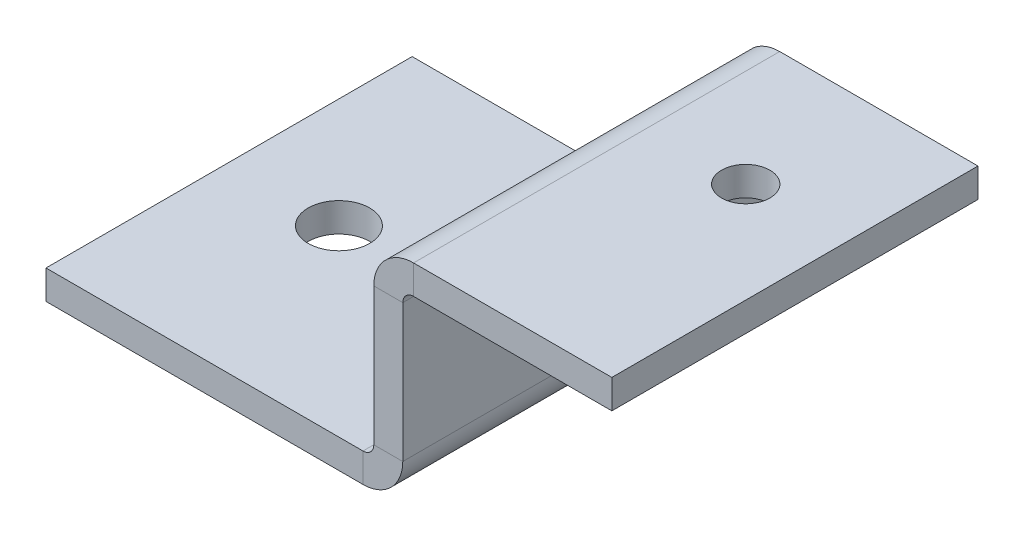
ISO-10303-21;
HEADER;
FILE_DESCRIPTION(('STEP AP214'),'2;1');
FILE_NAME('part.step','',(''),(''),'','','');
FILE_SCHEMA(('AUTOMOTIVE_DESIGN { 1 0 10303 214 1 1 1 1 }'));
ENDSEC;
DATA;
#1=APPLICATION_CONTEXT('core data for automotive mechanical design processes');
#2=APPLICATION_PROTOCOL_DEFINITION('international standard','automotive_design',2000,#1);
#3=PRODUCT_CONTEXT('',#1,'mechanical');
#4=PRODUCT('Part','Part','',(#3));
#5=PRODUCT_RELATED_PRODUCT_CATEGORY('part','',(#4));
#6=PRODUCT_DEFINITION_FORMATION('','',#4);
#7=PRODUCT_DEFINITION_CONTEXT('part definition',#1,'design');
#8=PRODUCT_DEFINITION('design','',#6,#7);
#9=PRODUCT_DEFINITION_SHAPE('','',#8);
#10=(LENGTH_UNIT() NAMED_UNIT(*) SI_UNIT(.MILLI.,.METRE.));
#11=(NAMED_UNIT(*) PLANE_ANGLE_UNIT() SI_UNIT($,.RADIAN.));
#12=(NAMED_UNIT(*) SI_UNIT($,.STERADIAN.) SOLID_ANGLE_UNIT());
#13=UNCERTAINTY_MEASURE_WITH_UNIT(LENGTH_MEASURE(1.E-05),#10,'distance_accuracy_value','');
#14=(GEOMETRIC_REPRESENTATION_CONTEXT(3) GLOBAL_UNCERTAINTY_ASSIGNED_CONTEXT((#13)) GLOBAL_UNIT_ASSIGNED_CONTEXT((#10,
#11,#12)) REPRESENTATION_CONTEXT('',''));
#15=CARTESIAN_POINT('',(0.,0.,0.));
#16=DIRECTION('',(0.,0.,1.));
#17=DIRECTION('',(1.,0.,0.));
#18=AXIS2_PLACEMENT_3D('',#15,#16,#17);
#19=CARTESIAN_POINT('',(-0.639468468922137,26.380531531078,-12.5));
#20=DIRECTION('',(0.,0.,-1.));
#21=DIRECTION('',(0.,-1.,0.));
#22=AXIS2_PLACEMENT_3D('',#19,#20,#21);
#23=PLANE('',#22);
#24=DIRECTION('',(0.,-1.,0.));
#25=VECTOR('',#24,1.);
#26=CARTESIAN_POINT('',(-2.61946846892214,26.380531531078,-12.5));
#27=LINE('',#26,#25);
#28=CARTESIAN_POINT('',(-2.61946846892208,10.130531531078,-12.5));
#29=VERTEX_POINT('',#28);
#30=CARTESIAN_POINT('',(-2.61946846892205,0.736600000000006,-12.5));
#31=VERTEX_POINT('',#30);
#32=EDGE_CURVE('E72',#29,#31,#27,.T.);
#33=ORIENTED_EDGE('',*,*,#32,.F.);
#34=DIRECTION('',(1.,0.,0.));
#35=VECTOR('',#34,1.);
#36=CARTESIAN_POINT('',(-0.639468468922081,10.130531531078,-12.5));
#37=LINE('',#36,#35);
#38=CARTESIAN_POINT('',(-0.639468468922081,10.130531531078,-12.5));
#39=VERTEX_POINT('',#38);
#40=EDGE_CURVE('E243',#29,#39,#37,.T.);
#41=ORIENTED_EDGE('',*,*,#40,.T.);
#42=DIRECTION('',(0.,-1.,0.));
#43=VECTOR('',#42,1.);
#44=CARTESIAN_POINT('',(-0.639468468922137,26.380531531078,-12.5));
#45=LINE('',#44,#43);
#46=CARTESIAN_POINT('',(-0.639468468922048,0.736600000000013,-12.5));
#47=VERTEX_POINT('',#46);
#48=EDGE_CURVE('E249',#39,#47,#45,.T.);
#49=ORIENTED_EDGE('',*,*,#48,.T.);
#50=DIRECTION('',(1.,0.,0.));
#51=VECTOR('',#50,1.);
#52=CARTESIAN_POINT('',(-0.639468468922048,0.736600000000013,-12.5));
#53=LINE('',#52,#51);
#54=EDGE_CURVE('E237',#31,#47,#53,.T.);
#55=ORIENTED_EDGE('',*,*,#54,.F.);
#56=EDGE_LOOP('',(#33,#41,#49,#55));
#57=FACE_BOUND('',#56,.T.);
#58=ADVANCED_FACE('F47',(#57),#23,.T.);
#59=CARTESIAN_POINT('',(-0.639468468922134,26.380531531078,12.5));
#60=DIRECTION('',(0.,0.,1.));
#61=DIRECTION('',(0.,1.,0.));
#62=AXIS2_PLACEMENT_3D('',#59,#60,#61);
#63=PLANE('',#62);
#64=DIRECTION('',(0.,1.,0.));
#65=VECTOR('',#64,1.);
#66=CARTESIAN_POINT('',(-0.639468468922134,26.380531531078,12.5));
#67=LINE('',#66,#65);
#68=CARTESIAN_POINT('',(-0.639468468922042,0.736600000000008,12.5));
#69=VERTEX_POINT('',#68);
#70=CARTESIAN_POINT('',(-0.639468468922078,10.130531531078,12.5));
#71=VERTEX_POINT('',#70);
#72=EDGE_CURVE('E232',#69,#71,#67,.T.);
#73=ORIENTED_EDGE('',*,*,#72,.T.);
#74=DIRECTION('',(-1.,0.,0.));
#75=VECTOR('',#74,1.);
#76=CARTESIAN_POINT('',(-0.639468468922077,10.130531531078,12.5));
#77=LINE('',#76,#75);
#78=CARTESIAN_POINT('',(-2.61946846892208,10.130531531078,12.5));
#79=VERTEX_POINT('',#78);
#80=EDGE_CURVE('E12',#71,#79,#77,.T.);
#81=ORIENTED_EDGE('',*,*,#80,.T.);
#82=DIRECTION('',(0.,1.,0.));
#83=VECTOR('',#82,1.);
#84=CARTESIAN_POINT('',(-2.61946846892213,26.380531531078,12.5));
#85=LINE('',#84,#83);
#86=CARTESIAN_POINT('',(-2.61946846892204,0.736600000000003,12.5));
#87=VERTEX_POINT('',#86);
#88=EDGE_CURVE('E250',#87,#79,#85,.T.);
#89=ORIENTED_EDGE('',*,*,#88,.F.);
#90=DIRECTION('',(-1.,0.,0.));
#91=VECTOR('',#90,1.);
#92=CARTESIAN_POINT('',(-0.639468468922045,0.736600000000013,12.5));
#93=LINE('',#92,#91);
#94=EDGE_CURVE('E231',#69,#87,#93,.T.);
#95=ORIENTED_EDGE('',*,*,#94,.F.);
#96=EDGE_LOOP('',(#73,#81,#89,#95));
#97=FACE_BOUND('',#96,.T.);
#98=ADVANCED_FACE('F49',(#97),#63,.T.);
#99=CARTESIAN_POINT('',(-0.639468468922049,1.38053153107798,0.));
#100=DIRECTION('',(1.,0.,0.));
#101=DIRECTION('',(0.,0.,-1.));
#102=AXIS2_PLACEMENT_3D('',#99,#100,#101);
#103=PLANE('',#102);
#104=ORIENTED_EDGE('',*,*,#48,.F.);
#105=DIRECTION('',(0.,0.,1.));
#106=VECTOR('',#105,1.);
#107=CARTESIAN_POINT('',(-0.639468468922079,10.130531531078,0.));
#108=LINE('',#107,#106);
#109=EDGE_CURVE('E240',#39,#71,#108,.T.);
#110=ORIENTED_EDGE('',*,*,#109,.T.);
#111=ORIENTED_EDGE('',*,*,#72,.F.);
#112=DIRECTION('',(0.,0.,1.));
#113=VECTOR('',#112,1.);
#114=CARTESIAN_POINT('',(-0.639468468922046,0.736600000000012,0.));
#115=LINE('',#114,#113);
#116=EDGE_CURVE('E228',#47,#69,#115,.T.);
#117=ORIENTED_EDGE('',*,*,#116,.F.);
#118=EDGE_LOOP('',(#104,#110,#111,#117));
#119=FACE_BOUND('',#118,.T.);
#120=ADVANCED_FACE('F288',(#119),#103,.T.);
#121=CARTESIAN_POINT('',(-2.61946846892205,1.38053153107797,0.));
#122=DIRECTION('',(1.,0.,0.));
#123=DIRECTION('',(0.,0.,-1.));
#124=AXIS2_PLACEMENT_3D('',#121,#122,#123);
#125=PLANE('',#124);
#126=DIRECTION('',(0.,0.,1.));
#127=VECTOR('',#126,1.);
#128=CARTESIAN_POINT('',(-2.61946846892208,10.130531531078,0.));
#129=LINE('',#128,#127);
#130=EDGE_CURVE('E56',#29,#79,#129,.T.);
#131=ORIENTED_EDGE('',*,*,#130,.F.);
#132=ORIENTED_EDGE('',*,*,#32,.T.);
#133=DIRECTION('',(0.,0.,1.));
#134=VECTOR('',#133,1.);
#135=CARTESIAN_POINT('',(-2.61946846892205,0.736600000000005,0.));
#136=LINE('',#135,#134);
#137=EDGE_CURVE('E235',#31,#87,#136,.T.);
#138=ORIENTED_EDGE('',*,*,#137,.T.);
#139=ORIENTED_EDGE('',*,*,#88,.T.);
#140=EDGE_LOOP('',(#131,#132,#138,#139));
#141=FACE_BOUND('',#140,.T.);
#142=ADVANCED_FACE('F342',(#141),#125,.F.);
#143=CARTESIAN_POINT('',(-25.,-1.98,12.5));
#144=DIRECTION('',(-1.,0.,0.));
#145=DIRECTION('',(0.,0.,1.));
#146=AXIS2_PLACEMENT_3D('',#143,#144,#145);
#147=PLANE('',#146);
#148=DIRECTION('',(0.,0.,1.));
#149=VECTOR('',#148,1.);
#150=CARTESIAN_POINT('',(-25.,0.,12.5));
#151=LINE('',#150,#149);
#152=CARTESIAN_POINT('',(-25.,0.,-12.5));
#153=VERTEX_POINT('',#152);
#154=CARTESIAN_POINT('',(-25.,0.,12.5));
#155=VERTEX_POINT('',#154);
#156=EDGE_CURVE('E207',#153,#155,#151,.T.);
#157=ORIENTED_EDGE('',*,*,#156,.F.);
#158=DIRECTION('',(0.,1.,0.));
#159=VECTOR('',#158,1.);
#160=CARTESIAN_POINT('',(-25.,-1.98,-12.5));
#161=LINE('',#160,#159);
#162=CARTESIAN_POINT('',(-25.,-1.98,-12.5));
#163=VERTEX_POINT('',#162);
#164=EDGE_CURVE('E196',#163,#153,#161,.T.);
#165=ORIENTED_EDGE('',*,*,#164,.F.);
#166=DIRECTION('',(0.,0.,1.));
#167=VECTOR('',#166,1.);
#168=CARTESIAN_POINT('',(-25.,-1.98,12.5));
#169=LINE('',#168,#167);
#170=CARTESIAN_POINT('',(-25.,-1.98,12.5));
#171=VERTEX_POINT('',#170);
#172=EDGE_CURVE('E223',#163,#171,#169,.T.);
#173=ORIENTED_EDGE('',*,*,#172,.T.);
#174=DIRECTION('',(0.,1.,0.));
#175=VECTOR('',#174,1.);
#176=CARTESIAN_POINT('',(-25.,-1.98,12.5));
#177=LINE('',#176,#175);
#178=EDGE_CURVE('E221',#171,#155,#177,.T.);
#179=ORIENTED_EDGE('',*,*,#178,.T.);
#180=EDGE_LOOP('',(#157,#165,#173,#179));
#181=FACE_BOUND('',#180,.T.);
#182=ADVANCED_FACE('F344',(#181),#147,.T.);
#183=CARTESIAN_POINT('',(0.,-1.98,0.));
#184=DIRECTION('',(0.,-1.,0.));
#185=DIRECTION('',(0.,0.,-1.));
#186=AXIS2_PLACEMENT_3D('',#183,#184,#185);
#187=PLANE('',#186);
#188=CARTESIAN_POINT('',(-17.5,-1.98,0.));
#189=DIRECTION('',(0.,-1.,0.));
#190=DIRECTION('',(0.,0.,-1.));
#191=AXIS2_PLACEMENT_3D('',#188,#189,#190);
#192=CIRCLE('',#191,2.1);
#193=CARTESIAN_POINT('',(-17.5,-1.98,-2.1));
#194=VERTEX_POINT('',#193);
#195=EDGE_CURVE('E255',#194,#194,#192,.T.);
#196=ORIENTED_EDGE('',*,*,#195,.F.);
#197=EDGE_LOOP('',(#196));
#198=FACE_BOUND('',#197,.T.);
#199=DIRECTION('',(-1.,0.,0.));
#200=VECTOR('',#199,1.);
#201=CARTESIAN_POINT('',(25.,-1.98,-12.5));
#202=LINE('',#201,#200);
#203=CARTESIAN_POINT('',(-3.35606846892205,-1.98,-12.5));
#204=VERTEX_POINT('',#203);
#205=EDGE_CURVE('E199',#204,#163,#202,.T.);
#206=ORIENTED_EDGE('',*,*,#205,.F.);
#207=DIRECTION('',(0.,0.,1.));
#208=VECTOR('',#207,1.);
#209=CARTESIAN_POINT('',(-3.35606846892204,-1.98,0.));
#210=LINE('',#209,#208);
#211=CARTESIAN_POINT('',(-3.35606846892204,-1.98,12.5));
#212=VERTEX_POINT('',#211);
#213=EDGE_CURVE('E218',#204,#212,#210,.T.);
#214=ORIENTED_EDGE('',*,*,#213,.T.);
#215=DIRECTION('',(1.,0.,0.));
#216=VECTOR('',#215,1.);
#217=CARTESIAN_POINT('',(25.,-1.98,12.5));
#218=LINE('',#217,#216);
#219=EDGE_CURVE('E215',#171,#212,#218,.T.);
#220=ORIENTED_EDGE('',*,*,#219,.F.);
#221=ORIENTED_EDGE('',*,*,#172,.F.);
#222=EDGE_LOOP('',(#206,#214,#220,#221));
#223=FACE_BOUND('',#222,.T.);
#224=ADVANCED_FACE('F313',(#198,#223),#187,.T.);
#225=CARTESIAN_POINT('',(25.,-1.98,12.5));
#226=DIRECTION('',(0.,0.,1.));
#227=DIRECTION('',(1.,0.,0.));
#228=AXIS2_PLACEMENT_3D('',#225,#226,#227);
#229=PLANE('',#228);
#230=ORIENTED_EDGE('',*,*,#219,.T.);
#231=DIRECTION('',(0.,1.,0.));
#232=VECTOR('',#231,1.);
#233=CARTESIAN_POINT('',(-3.35606846892204,-1.98,12.5));
#234=LINE('',#233,#232);
#235=CARTESIAN_POINT('',(-3.35606846892204,0.,12.5));
#236=VERTEX_POINT('',#235);
#237=EDGE_CURVE('E212',#212,#236,#234,.T.);
#238=ORIENTED_EDGE('',*,*,#237,.T.);
#239=DIRECTION('',(1.,0.,0.));
#240=VECTOR('',#239,1.);
#241=CARTESIAN_POINT('',(25.,0.,12.5));
#242=LINE('',#241,#240);
#243=EDGE_CURVE('E204',#155,#236,#242,.T.);
#244=ORIENTED_EDGE('',*,*,#243,.F.);
#245=ORIENTED_EDGE('',*,*,#178,.F.);
#246=EDGE_LOOP('',(#230,#238,#244,#245));
#247=FACE_BOUND('',#246,.T.);
#248=ADVANCED_FACE('F306',(#247),#229,.T.);
#249=CARTESIAN_POINT('',(0.,0.,0.));
#250=DIRECTION('',(0.,-1.,0.));
#251=DIRECTION('',(0.,0.,-1.));
#252=AXIS2_PLACEMENT_3D('',#249,#250,#251);
#253=PLANE('',#252);
#254=CARTESIAN_POINT('',(-17.5,0.,0.));
#255=DIRECTION('',(0.,-1.,0.));
#256=DIRECTION('',(0.,0.,-1.));
#257=AXIS2_PLACEMENT_3D('',#254,#255,#256);
#258=CIRCLE('',#257,2.1);
#259=CARTESIAN_POINT('',(-17.5,0.,-2.1));
#260=VERTEX_POINT('',#259);
#261=EDGE_CURVE('E174',#260,#260,#258,.T.);
#262=ORIENTED_EDGE('',*,*,#261,.T.);
#263=EDGE_LOOP('',(#262));
#264=FACE_BOUND('',#263,.T.);
#265=DIRECTION('',(0.,0.,1.));
#266=VECTOR('',#265,1.);
#267=CARTESIAN_POINT('',(-3.35606846892204,0.,0.));
#268=LINE('',#267,#266);
#269=CARTESIAN_POINT('',(-3.35606846892205,0.,-12.5));
#270=VERTEX_POINT('',#269);
#271=EDGE_CURVE('E192',#270,#236,#268,.T.);
#272=ORIENTED_EDGE('',*,*,#271,.F.);
#273=DIRECTION('',(-1.,0.,0.));
#274=VECTOR('',#273,1.);
#275=CARTESIAN_POINT('',(25.,0.,-12.5));
#276=LINE('',#275,#274);
#277=EDGE_CURVE('E210',#270,#153,#276,.T.);
#278=ORIENTED_EDGE('',*,*,#277,.T.);
#279=ORIENTED_EDGE('',*,*,#156,.T.);
#280=ORIENTED_EDGE('',*,*,#243,.T.);
#281=EDGE_LOOP('',(#272,#278,#279,#280));
#282=FACE_BOUND('',#281,.T.);
#283=ADVANCED_FACE('F303',(#264,#282),#253,.F.);
#284=CARTESIAN_POINT('',(25.,-1.98,-12.5));
#285=DIRECTION('',(0.,0.,-1.));
#286=DIRECTION('',(-1.,0.,0.));
#287=AXIS2_PLACEMENT_3D('',#284,#285,#286);
#288=PLANE('',#287);
#289=ORIENTED_EDGE('',*,*,#277,.F.);
#290=DIRECTION('',(0.,-1.,0.));
#291=VECTOR('',#290,1.);
#292=CARTESIAN_POINT('',(-3.35606846892205,-1.98,-12.5));
#293=LINE('',#292,#291);
#294=EDGE_CURVE('E201',#270,#204,#293,.T.);
#295=ORIENTED_EDGE('',*,*,#294,.T.);
#296=ORIENTED_EDGE('',*,*,#205,.T.);
#297=ORIENTED_EDGE('',*,*,#164,.T.);
#298=EDGE_LOOP('',(#289,#295,#296,#297));
#299=FACE_BOUND('',#298,.T.);
#300=ADVANCED_FACE('F317',(#299),#288,.T.);
#301=CARTESIAN_POINT('',(-3.35606846892205,0.7366,-12.5));
#302=DIRECTION('',(0.,0.,-1.));
#303=DIRECTION('',(-1.,0.,0.));
#304=AXIS2_PLACEMENT_3D('',#301,#302,#303);
#305=PLANE('',#304);
#306=ORIENTED_EDGE('',*,*,#294,.F.);
#307=CARTESIAN_POINT('',(-3.35606846892205,0.7366,-12.5));
#308=DIRECTION('',(0.,0.,1.));
#309=DIRECTION('',(1.,0.,0.));
#310=AXIS2_PLACEMENT_3D('',#307,#308,#309);
#311=CIRCLE('',#310,0.7366);
#312=EDGE_CURVE('E181',#270,#31,#311,.T.);
#313=ORIENTED_EDGE('',*,*,#312,.T.);
#314=ORIENTED_EDGE('',*,*,#54,.T.);
#315=CARTESIAN_POINT('',(-3.35606846892205,0.7366,-12.5));
#316=DIRECTION('',(0.,0.,1.));
#317=DIRECTION('',(-1.,0.,0.));
#318=AXIS2_PLACEMENT_3D('',#315,#316,#317);
#319=CIRCLE('',#318,2.7166);
#320=EDGE_CURVE('E185',#204,#47,#319,.T.);
#321=ORIENTED_EDGE('',*,*,#320,.F.);
#322=EDGE_LOOP('',(#306,#313,#314,#321));
#323=FACE_BOUND('',#322,.T.);
#324=ADVANCED_FACE('F319',(#323),#305,.T.);
#325=CARTESIAN_POINT('',(-3.35606846892204,0.7366,12.5));
#326=DIRECTION('',(0.,0.,1.));
#327=DIRECTION('',(1.,0.,0.));
#328=AXIS2_PLACEMENT_3D('',#325,#326,#327);
#329=PLANE('',#328);
#330=CARTESIAN_POINT('',(-3.35606846892204,0.7366,12.5));
#331=DIRECTION('',(0.,0.,1.));
#332=DIRECTION('',(1.,0.,0.));
#333=AXIS2_PLACEMENT_3D('',#330,#331,#332);
#334=CIRCLE('',#333,0.7366);
#335=EDGE_CURVE('E189',#87,#236,#334,.F.);
#336=ORIENTED_EDGE('',*,*,#335,.T.);
#337=ORIENTED_EDGE('',*,*,#237,.F.);
#338=CARTESIAN_POINT('',(-3.35606846892204,0.7366,12.5));
#339=DIRECTION('',(0.,0.,-1.));
#340=DIRECTION('',(1.,0.,0.));
#341=AXIS2_PLACEMENT_3D('',#338,#339,#340);
#342=CIRCLE('',#341,2.7166);
#343=EDGE_CURVE('E188',#69,#212,#342,.T.);
#344=ORIENTED_EDGE('',*,*,#343,.F.);
#345=ORIENTED_EDGE('',*,*,#94,.T.);
#346=EDGE_LOOP('',(#336,#337,#344,#345));
#347=FACE_BOUND('',#346,.T.);
#348=ADVANCED_FACE('F294',(#347),#329,.T.);
#349=CARTESIAN_POINT('',(-3.35606846892205,0.7366,-25.2245136081871));
#350=DIRECTION('',(0.,0.,1.));
#351=DIRECTION('',(1.,0.,0.));
#352=AXIS2_PLACEMENT_3D('',#349,#350,#351);
#353=CYLINDRICAL_SURFACE('',#352,2.7166);
#354=ORIENTED_EDGE('',*,*,#116,.T.);
#355=ORIENTED_EDGE('',*,*,#343,.T.);
#356=ORIENTED_EDGE('',*,*,#213,.F.);
#357=ORIENTED_EDGE('',*,*,#320,.T.);
#358=EDGE_LOOP('',(#354,#355,#356,#357));
#359=FACE_BOUND('',#358,.T.);
#360=ADVANCED_FACE('F309',(#359),#353,.T.);
#361=CARTESIAN_POINT('',(-3.35606846892205,0.7366,-25.2245136081871));
#362=DIRECTION('',(0.,0.,1.));
#363=DIRECTION('',(1.,0.,0.));
#364=AXIS2_PLACEMENT_3D('',#361,#362,#363);
#365=CYLINDRICAL_SURFACE('',#364,0.7366);
#366=ORIENTED_EDGE('',*,*,#137,.F.);
#367=ORIENTED_EDGE('',*,*,#312,.F.);
#368=ORIENTED_EDGE('',*,*,#271,.T.);
#369=ORIENTED_EDGE('',*,*,#335,.F.);
#370=EDGE_LOOP('',(#366,#367,#368,#369));
#371=FACE_BOUND('',#370,.T.);
#372=ADVANCED_FACE('F297',(#371),#365,.F.);
#373=CARTESIAN_POINT('',(0.0971315310779191,10.130531531078,-12.5));
#374=DIRECTION('',(0.,0.,1.));
#375=DIRECTION('',(1.,0.,0.));
#376=AXIS2_PLACEMENT_3D('',#373,#374,#375);
#377=PLANE('',#376);
#378=ORIENTED_EDGE('',*,*,#40,.F.);
#379=CARTESIAN_POINT('',(0.0971315310779192,10.130531531078,-12.5));
#380=DIRECTION('',(0.,0.,1.));
#381=DIRECTION('',(1.,0.,0.));
#382=AXIS2_PLACEMENT_3D('',#379,#380,#381);
#383=CIRCLE('',#382,2.7166);
#384=CARTESIAN_POINT('',(0.0971315310779198,12.847131531078,-12.5));
#385=VERTEX_POINT('',#384);
#386=EDGE_CURVE('E157',#29,#385,#383,.F.);
#387=ORIENTED_EDGE('',*,*,#386,.T.);
#388=DIRECTION('',(0.,-1.,0.));
#389=VECTOR('',#388,1.);
#390=CARTESIAN_POINT('',(0.0971315310779163,10.867131531078,-12.5));
#391=LINE('',#390,#389);
#392=CARTESIAN_POINT('',(0.0971315310779163,10.867131531078,-12.5));
#393=VERTEX_POINT('',#392);
#394=EDGE_CURVE('E164',#385,#393,#391,.T.);
#395=ORIENTED_EDGE('',*,*,#394,.T.);
#396=CARTESIAN_POINT('',(0.0971315310779191,10.130531531078,-12.5));
#397=DIRECTION('',(0.,0.,-1.));
#398=DIRECTION('',(1.,0.,0.));
#399=AXIS2_PLACEMENT_3D('',#396,#397,#398);
#400=CIRCLE('',#399,0.736599999999999);
#401=EDGE_CURVE('E175',#39,#393,#400,.T.);
#402=ORIENTED_EDGE('',*,*,#401,.F.);
#403=EDGE_LOOP('',(#378,#387,#395,#402));
#404=FACE_BOUND('',#403,.T.);
#405=ADVANCED_FACE('F280',(#404),#377,.F.);
#406=CARTESIAN_POINT('',(0.0971315310779226,10.130531531078,12.5));
#407=DIRECTION('',(0.,0.,-1.));
#408=DIRECTION('',(-1.,0.,0.));
#409=AXIS2_PLACEMENT_3D('',#406,#407,#408);
#410=PLANE('',#409);
#411=CARTESIAN_POINT('',(0.0971315310779226,10.130531531078,12.5));
#412=DIRECTION('',(0.,0.,1.));
#413=DIRECTION('',(1.,0.,0.));
#414=AXIS2_PLACEMENT_3D('',#411,#412,#413);
#415=CIRCLE('',#414,2.7166);
#416=CARTESIAN_POINT('',(0.097131531077925,12.847131531078,12.5));
#417=VERTEX_POINT('',#416);
#418=EDGE_CURVE('E64',#417,#79,#415,.T.);
#419=ORIENTED_EDGE('',*,*,#418,.T.);
#420=ORIENTED_EDGE('',*,*,#80,.F.);
#421=CARTESIAN_POINT('',(0.0971315310779226,10.130531531078,12.5));
#422=DIRECTION('',(0.,0.,1.));
#423=DIRECTION('',(-1.,0.,0.));
#424=AXIS2_PLACEMENT_3D('',#421,#422,#423);
#425=CIRCLE('',#424,0.736599999999999);
#426=CARTESIAN_POINT('',(0.0971315310779253,10.867131531078,12.5));
#427=VERTEX_POINT('',#426);
#428=EDGE_CURVE('E178',#427,#71,#425,.T.);
#429=ORIENTED_EDGE('',*,*,#428,.F.);
#430=DIRECTION('',(0.,1.,0.));
#431=VECTOR('',#430,1.);
#432=CARTESIAN_POINT('',(0.0971315310779215,10.867131531078,12.5));
#433=LINE('',#432,#431);
#434=EDGE_CURVE('E146',#427,#417,#433,.T.);
#435=ORIENTED_EDGE('',*,*,#434,.T.);
#436=EDGE_LOOP('',(#419,#420,#429,#435));
#437=FACE_BOUND('',#436,.T.);
#438=ADVANCED_FACE('F325',(#437),#410,.F.);
#439=CARTESIAN_POINT('',(0.0971315310779174,10.130531531078,-25.2245136081871));
#440=DIRECTION('',(0.,0.,1.));
#441=DIRECTION('',(1.,0.,0.));
#442=AXIS2_PLACEMENT_3D('',#439,#440,#441);
#443=CYLINDRICAL_SURFACE('',#442,0.7366);
#444=DIRECTION('',(0.,0.,1.));
#445=VECTOR('',#444,1.);
#446=CARTESIAN_POINT('',(0.0971315310779198,10.867131531078,0.));
#447=LINE('',#446,#445);
#448=EDGE_CURVE('E172',#393,#427,#447,.T.);
#449=ORIENTED_EDGE('',*,*,#448,.T.);
#450=ORIENTED_EDGE('',*,*,#428,.T.);
#451=ORIENTED_EDGE('',*,*,#109,.F.);
#452=ORIENTED_EDGE('',*,*,#401,.T.);
#453=EDGE_LOOP('',(#449,#450,#451,#452));
#454=FACE_BOUND('',#453,.T.);
#455=ADVANCED_FACE('F284',(#454),#443,.F.);
#456=CARTESIAN_POINT('',(0.0971315310779174,10.130531531078,-25.2245136081871));
#457=DIRECTION('',(0.,0.,1.));
#458=DIRECTION('',(1.,0.,0.));
#459=AXIS2_PLACEMENT_3D('',#456,#457,#458);
#460=CYLINDRICAL_SURFACE('',#459,2.7166);
#461=DIRECTION('',(0.,0.,1.));
#462=VECTOR('',#461,1.);
#463=CARTESIAN_POINT('',(0.0971315310779198,12.847131531078,0.));
#464=LINE('',#463,#462);
#465=EDGE_CURVE('E269',#385,#417,#464,.T.);
#466=ORIENTED_EDGE('',*,*,#465,.F.);
#467=ORIENTED_EDGE('',*,*,#386,.F.);
#468=ORIENTED_EDGE('',*,*,#130,.T.);
#469=ORIENTED_EDGE('',*,*,#418,.F.);
#470=EDGE_LOOP('',(#466,#467,#468,#469));
#471=FACE_BOUND('',#470,.T.);
#472=ADVANCED_FACE('F322',(#471),#460,.T.);
#473=CARTESIAN_POINT('',(13.6349945932338,10.867131531078,12.5));
#474=DIRECTION('',(1.,0.,0.));
#475=DIRECTION('',(0.,0.,-1.));
#476=AXIS2_PLACEMENT_3D('',#473,#474,#475);
#477=PLANE('',#476);
#478=DIRECTION('',(0.,0.,-1.));
#479=VECTOR('',#478,1.);
#480=CARTESIAN_POINT('',(13.6349945932338,12.847131531078,12.5));
#481=LINE('',#480,#479);
#482=CARTESIAN_POINT('',(13.6349945932338,12.847131531078,12.5));
#483=VERTEX_POINT('',#482);
#484=CARTESIAN_POINT('',(13.6349945932338,12.847131531078,-12.5));
#485=VERTEX_POINT('',#484);
#486=EDGE_CURVE('E150',#483,#485,#481,.T.);
#487=ORIENTED_EDGE('',*,*,#486,.F.);
#488=DIRECTION('',(0.,1.,0.));
#489=VECTOR('',#488,1.);
#490=CARTESIAN_POINT('',(13.6349945932338,10.867131531078,12.5));
#491=LINE('',#490,#489);
#492=CARTESIAN_POINT('',(13.6349945932338,10.867131531078,12.5));
#493=VERTEX_POINT('',#492);
#494=EDGE_CURVE('E144',#493,#483,#491,.T.);
#495=ORIENTED_EDGE('',*,*,#494,.F.);
#496=DIRECTION('',(0.,0.,-1.));
#497=VECTOR('',#496,1.);
#498=CARTESIAN_POINT('',(13.6349945932338,10.867131531078,12.5));
#499=LINE('',#498,#497);
#500=CARTESIAN_POINT('',(13.6349945932338,10.867131531078,-12.5));
#501=VERTEX_POINT('',#500);
#502=EDGE_CURVE('E155',#493,#501,#499,.T.);
#503=ORIENTED_EDGE('',*,*,#502,.T.);
#504=DIRECTION('',(0.,1.,0.));
#505=VECTOR('',#504,1.);
#506=CARTESIAN_POINT('',(13.6349945932338,10.867131531078,-12.5));
#507=LINE('',#506,#505);
#508=EDGE_CURVE('E163',#501,#485,#507,.T.);
#509=ORIENTED_EDGE('',*,*,#508,.T.);
#510=EDGE_LOOP('',(#487,#495,#503,#509));
#511=FACE_BOUND('',#510,.T.);
#512=ADVANCED_FACE('F154',(#511),#477,.T.);
#513=CARTESIAN_POINT('',(-11.3650054067662,10.867131531078,0.));
#514=DIRECTION('',(0.,-1.,0.));
#515=DIRECTION('',(0.,0.,-1.));
#516=AXIS2_PLACEMENT_3D('',#513,#514,#515);
#517=PLANE('',#516);
#518=CARTESIAN_POINT('',(6.77500000000069,10.867131531078,-3.50000000006402));
#519=DIRECTION('',(0.,-1.,0.));
#520=DIRECTION('',(0.,0.,-1.));
#521=AXIS2_PLACEMENT_3D('',#518,#519,#520);
#522=CIRCLE('',#521,1.65);
#523=CARTESIAN_POINT('',(6.77500000000069,10.867131531078,-5.15000000006402));
#524=VERTEX_POINT('',#523);
#525=EDGE_CURVE('E263',#524,#524,#522,.T.);
#526=ORIENTED_EDGE('',*,*,#525,.F.);
#527=EDGE_LOOP('',(#526));
#528=FACE_BOUND('',#527,.T.);
#529=ORIENTED_EDGE('',*,*,#448,.F.);
#530=DIRECTION('',(-1.,0.,0.));
#531=VECTOR('',#530,1.);
#532=CARTESIAN_POINT('',(13.6349945932338,10.867131531078,-12.5));
#533=LINE('',#532,#531);
#534=EDGE_CURVE('E162',#501,#393,#533,.T.);
#535=ORIENTED_EDGE('',*,*,#534,.F.);
#536=ORIENTED_EDGE('',*,*,#502,.F.);
#537=DIRECTION('',(1.,0.,0.));
#538=VECTOR('',#537,1.);
#539=CARTESIAN_POINT('',(13.6349945932338,10.867131531078,12.5));
#540=LINE('',#539,#538);
#541=EDGE_CURVE('E141',#427,#493,#540,.T.);
#542=ORIENTED_EDGE('',*,*,#541,.F.);
#543=EDGE_LOOP('',(#529,#535,#536,#542));
#544=FACE_BOUND('',#543,.T.);
#545=ADVANCED_FACE('F160',(#528,#544),#517,.T.);
#546=CARTESIAN_POINT('',(13.6349945932338,10.867131531078,-12.5));
#547=DIRECTION('',(0.,0.,-1.));
#548=DIRECTION('',(-1.,0.,0.));
#549=AXIS2_PLACEMENT_3D('',#546,#547,#548);
#550=PLANE('',#549);
#551=ORIENTED_EDGE('',*,*,#394,.F.);
#552=DIRECTION('',(-1.,0.,0.));
#553=VECTOR('',#552,1.);
#554=CARTESIAN_POINT('',(13.6349945932338,12.847131531078,-12.5));
#555=LINE('',#554,#553);
#556=EDGE_CURVE('E272',#485,#385,#555,.T.);
#557=ORIENTED_EDGE('',*,*,#556,.F.);
#558=ORIENTED_EDGE('',*,*,#508,.F.);
#559=ORIENTED_EDGE('',*,*,#534,.T.);
#560=EDGE_LOOP('',(#551,#557,#558,#559));
#561=FACE_BOUND('',#560,.T.);
#562=ADVANCED_FACE('F275',(#561),#550,.T.);
#563=CARTESIAN_POINT('',(-11.3650054067662,12.847131531078,0.));
#564=DIRECTION('',(0.,-1.,0.));
#565=DIRECTION('',(0.,0.,-1.));
#566=AXIS2_PLACEMENT_3D('',#563,#564,#565);
#567=PLANE('',#566);
#568=CARTESIAN_POINT('',(6.77500000000069,12.847131531078,-3.50000000006402));
#569=DIRECTION('',(0.,-1.,0.));
#570=DIRECTION('',(0.,0.,-1.));
#571=AXIS2_PLACEMENT_3D('',#568,#569,#570);
#572=CIRCLE('',#571,1.65);
#573=CARTESIAN_POINT('',(6.77500000000069,12.847131531078,-5.15000000006402));
#574=VERTEX_POINT('',#573);
#575=EDGE_CURVE('E51',#574,#574,#572,.T.);
#576=ORIENTED_EDGE('',*,*,#575,.T.);
#577=EDGE_LOOP('',(#576));
#578=FACE_BOUND('',#577,.T.);
#579=ORIENTED_EDGE('',*,*,#556,.T.);
#580=ORIENTED_EDGE('',*,*,#465,.T.);
#581=DIRECTION('',(1.,0.,0.));
#582=VECTOR('',#581,1.);
#583=CARTESIAN_POINT('',(13.6349945932338,12.847131531078,12.5));
#584=LINE('',#583,#582);
#585=EDGE_CURVE('E267',#417,#483,#584,.T.);
#586=ORIENTED_EDGE('',*,*,#585,.T.);
#587=ORIENTED_EDGE('',*,*,#486,.T.);
#588=EDGE_LOOP('',(#579,#580,#586,#587));
#589=FACE_BOUND('',#588,.T.);
#590=ADVANCED_FACE('F324',(#578,#589),#567,.F.);
#591=CARTESIAN_POINT('',(13.6349945932338,10.867131531078,12.5));
#592=DIRECTION('',(0.,0.,1.));
#593=DIRECTION('',(1.,0.,0.));
#594=AXIS2_PLACEMENT_3D('',#591,#592,#593);
#595=PLANE('',#594);
#596=ORIENTED_EDGE('',*,*,#434,.F.);
#597=ORIENTED_EDGE('',*,*,#541,.T.);
#598=ORIENTED_EDGE('',*,*,#494,.T.);
#599=ORIENTED_EDGE('',*,*,#585,.F.);
#600=EDGE_LOOP('',(#596,#597,#598,#599));
#601=FACE_BOUND('',#600,.T.);
#602=ADVANCED_FACE('F143',(#601),#595,.T.);
#603=CARTESIAN_POINT('',(-17.5,8.02,0.));
#604=DIRECTION('',(0.,-1.,0.));
#605=DIRECTION('',(0.,0.,-1.));
#606=AXIS2_PLACEMENT_3D('',#603,#604,#605);
#607=CYLINDRICAL_SURFACE('',#606,2.1);
#608=ORIENTED_EDGE('',*,*,#195,.T.);
#609=EDGE_LOOP('',(#608));
#610=FACE_BOUND('',#609,.T.);
#611=ORIENTED_EDGE('',*,*,#261,.F.);
#612=EDGE_LOOP('',(#611));
#613=FACE_BOUND('',#612,.T.);
#614=ADVANCED_FACE('F453',(#610,#613),#607,.F.);
#615=CARTESIAN_POINT('',(6.77500000000069,20.867131531078,-3.50000000006402));
#616=DIRECTION('',(0.,-1.,0.));
#617=DIRECTION('',(0.,0.,-1.));
#618=AXIS2_PLACEMENT_3D('',#615,#616,#617);
#619=CYLINDRICAL_SURFACE('',#618,1.65);
#620=ORIENTED_EDGE('',*,*,#525,.T.);
#621=EDGE_LOOP('',(#620));
#622=FACE_BOUND('',#621,.T.);
#623=ORIENTED_EDGE('',*,*,#575,.F.);
#624=EDGE_LOOP('',(#623));
#625=FACE_BOUND('',#624,.T.);
#626=ADVANCED_FACE('F458',(#622,#625),#619,.F.);
#627=CLOSED_SHELL('',(#58,#98,#120,#142,#182,#224,#248,#283,#300,#324,#348,#360,#372,#405,#438,
#455,#472,#512,#545,#562,#590,#602,#614,#626));
#628=MANIFOLD_SOLID_BREP('B2',#627);
#629=ADVANCED_BREP_SHAPE_REPRESENTATION('',(#18,#628),#14);
#630=SHAPE_DEFINITION_REPRESENTATION(#9,#629);
ENDSEC;
END-ISO-10303-21;
